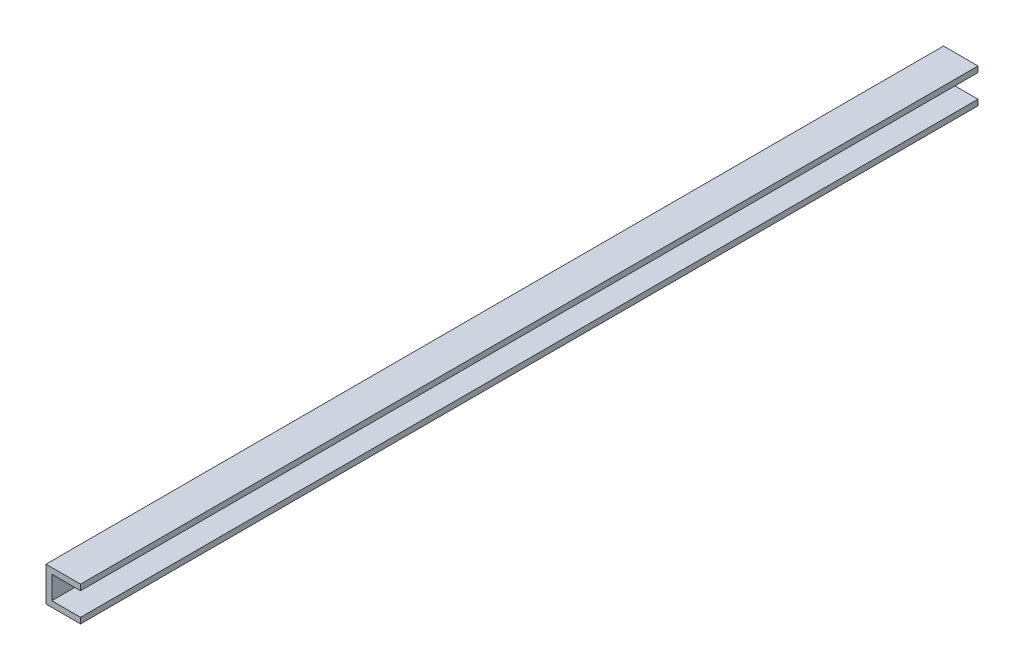
ISO-10303-21;
HEADER;
FILE_DESCRIPTION(('STEP AP214'),'2;1');
FILE_NAME('part.step','',(''),(''),'','','');
FILE_SCHEMA(('AUTOMOTIVE_DESIGN { 1 0 10303 214 1 1 1 1 }'));
ENDSEC;
DATA;
#1=APPLICATION_CONTEXT('core data for automotive mechanical design processes');
#2=APPLICATION_PROTOCOL_DEFINITION('international standard','automotive_design',2000,#1);
#3=PRODUCT_CONTEXT('',#1,'mechanical');
#4=PRODUCT('Part','Part','',(#3));
#5=PRODUCT_RELATED_PRODUCT_CATEGORY('part','',(#4));
#6=PRODUCT_DEFINITION_FORMATION('','',#4);
#7=PRODUCT_DEFINITION_CONTEXT('part definition',#1,'design');
#8=PRODUCT_DEFINITION('design','',#6,#7);
#9=PRODUCT_DEFINITION_SHAPE('','',#8);
#10=(LENGTH_UNIT() NAMED_UNIT(*) SI_UNIT(.MILLI.,.METRE.));
#11=(NAMED_UNIT(*) PLANE_ANGLE_UNIT() SI_UNIT($,.RADIAN.));
#12=(NAMED_UNIT(*) SI_UNIT($,.STERADIAN.) SOLID_ANGLE_UNIT());
#13=UNCERTAINTY_MEASURE_WITH_UNIT(LENGTH_MEASURE(1.E-05),#10,'distance_accuracy_value','');
#14=(GEOMETRIC_REPRESENTATION_CONTEXT(3) GLOBAL_UNCERTAINTY_ASSIGNED_CONTEXT((#13)) GLOBAL_UNIT_ASSIGNED_CONTEXT((#10,
#11,#12)) REPRESENTATION_CONTEXT('',''));
#15=CARTESIAN_POINT('',(0.,0.,0.));
#16=DIRECTION('',(0.,0.,1.));
#17=DIRECTION('',(1.,0.,0.));
#18=AXIS2_PLACEMENT_3D('',#15,#16,#17);
#19=CARTESIAN_POINT('',(0.,4.7625,123.825));
#20=DIRECTION('',(0.,-1.,0.));
#21=DIRECTION('',(1.,0.,0.));
#22=AXIS2_PLACEMENT_3D('',#19,#20,#21);
#23=PLANE('',#22);
#24=DIRECTION('',(-1.,0.,0.));
#25=VECTOR('',#24,1.);
#26=CARTESIAN_POINT('',(0.,4.7625,-123.825));
#27=LINE('',#26,#25);
#28=CARTESIAN_POINT('',(9.525,4.7625,-123.825));
#29=VERTEX_POINT('',#28);
#30=CARTESIAN_POINT('',(0.,4.7625,-123.825));
#31=VERTEX_POINT('',#30);
#32=EDGE_CURVE('E202',#29,#31,#27,.T.);
#33=ORIENTED_EDGE('',*,*,#32,.T.);
#34=DIRECTION('',(0.,0.,-1.));
#35=VECTOR('',#34,1.);
#36=CARTESIAN_POINT('',(0.,4.7625,123.825));
#37=LINE('',#36,#35);
#38=CARTESIAN_POINT('',(0.,4.7625,123.825));
#39=VERTEX_POINT('',#38);
#40=EDGE_CURVE('E263',#39,#31,#37,.T.);
#41=ORIENTED_EDGE('',*,*,#40,.F.);
#42=DIRECTION('',(-1.,0.,0.));
#43=VECTOR('',#42,1.);
#44=CARTESIAN_POINT('',(0.,4.7625,123.825));
#45=LINE('',#44,#43);
#46=CARTESIAN_POINT('',(9.525,4.7625,123.825));
#47=VERTEX_POINT('',#46);
#48=EDGE_CURVE('E209',#47,#39,#45,.T.);
#49=ORIENTED_EDGE('',*,*,#48,.F.);
#50=DIRECTION('',(0.,0.,-1.));
#51=VECTOR('',#50,1.);
#52=CARTESIAN_POINT('',(9.525,4.7625,123.825));
#53=LINE('',#52,#51);
#54=EDGE_CURVE('E227',#47,#29,#53,.T.);
#55=ORIENTED_EDGE('',*,*,#54,.T.);
#56=EDGE_LOOP('',(#33,#41,#49,#55));
#57=FACE_BOUND('',#56,.T.);
#58=ADVANCED_FACE('F46',(#57),#23,.F.);
#59=CARTESIAN_POINT('',(0.,4.7625,123.825));
#60=DIRECTION('',(1.,0.,0.));
#61=DIRECTION('',(0.,0.,-1.));
#62=AXIS2_PLACEMENT_3D('',#59,#60,#61);
#63=PLANE('',#62);
#64=CARTESIAN_POINT('',(0.,0.,-100.6475));
#65=DIRECTION('',(-1.,0.,0.));
#66=DIRECTION('',(0.,0.,1.));
#67=AXIS2_PLACEMENT_3D('',#64,#65,#66);
#68=CIRCLE('',#67,1.35254999999999);
#69=CARTESIAN_POINT('',(0.,0.,-99.29495));
#70=VERTEX_POINT('',#69);
#71=EDGE_CURVE('E377',#70,#70,#68,.T.);
#72=ORIENTED_EDGE('',*,*,#71,.F.);
#73=EDGE_LOOP('',(#72));
#74=FACE_BOUND('',#73,.T.);
#75=CARTESIAN_POINT('',(0.,0.,-87.80859375));
#76=DIRECTION('',(-1.,0.,0.));
#77=DIRECTION('',(0.,0.,1.));
#78=AXIS2_PLACEMENT_3D('',#75,#76,#77);
#79=CIRCLE('',#78,1.35254999999999);
#80=CARTESIAN_POINT('',(0.,0.,-86.45604375));
#81=VERTEX_POINT('',#80);
#82=EDGE_CURVE('E371',#81,#81,#79,.T.);
#83=ORIENTED_EDGE('',*,*,#82,.F.);
#84=EDGE_LOOP('',(#83));
#85=FACE_BOUND('',#84,.T.);
#86=CARTESIAN_POINT('',(0.,0.,-74.9696875));
#87=DIRECTION('',(-1.,0.,0.));
#88=DIRECTION('',(0.,0.,1.));
#89=AXIS2_PLACEMENT_3D('',#86,#87,#88);
#90=CIRCLE('',#89,1.35254999999999);
#91=CARTESIAN_POINT('',(0.,0.,-73.6171375));
#92=VERTEX_POINT('',#91);
#93=EDGE_CURVE('E365',#92,#92,#90,.T.);
#94=ORIENTED_EDGE('',*,*,#93,.F.);
#95=EDGE_LOOP('',(#94));
#96=FACE_BOUND('',#95,.T.);
#97=CARTESIAN_POINT('',(0.,0.,-62.13078125));
#98=DIRECTION('',(-1.,0.,0.));
#99=DIRECTION('',(0.,0.,1.));
#100=AXIS2_PLACEMENT_3D('',#97,#98,#99);
#101=CIRCLE('',#100,1.35254999999999);
#102=CARTESIAN_POINT('',(0.,0.,-60.77823125));
#103=VERTEX_POINT('',#102);
#104=EDGE_CURVE('E359',#103,#103,#101,.T.);
#105=ORIENTED_EDGE('',*,*,#104,.F.);
#106=EDGE_LOOP('',(#105));
#107=FACE_BOUND('',#106,.T.);
#108=CARTESIAN_POINT('',(0.,0.,-49.291875));
#109=DIRECTION('',(-1.,0.,0.));
#110=DIRECTION('',(0.,0.,1.));
#111=AXIS2_PLACEMENT_3D('',#108,#109,#110);
#112=CIRCLE('',#111,1.35254999999999);
#113=CARTESIAN_POINT('',(0.,0.,-47.9393250000001));
#114=VERTEX_POINT('',#113);
#115=EDGE_CURVE('E353',#114,#114,#112,.T.);
#116=ORIENTED_EDGE('',*,*,#115,.F.);
#117=EDGE_LOOP('',(#116));
#118=FACE_BOUND('',#117,.T.);
#119=CARTESIAN_POINT('',(0.,0.,-36.4529687500001));
#120=DIRECTION('',(-1.,0.,0.));
#121=DIRECTION('',(0.,0.,1.));
#122=AXIS2_PLACEMENT_3D('',#119,#120,#121);
#123=CIRCLE('',#122,1.35254999999999);
#124=CARTESIAN_POINT('',(0.,0.,-35.1004187500001));
#125=VERTEX_POINT('',#124);
#126=EDGE_CURVE('E347',#125,#125,#123,.T.);
#127=ORIENTED_EDGE('',*,*,#126,.F.);
#128=EDGE_LOOP('',(#127));
#129=FACE_BOUND('',#128,.T.);
#130=CARTESIAN_POINT('',(0.,0.,-23.6140625000001));
#131=DIRECTION('',(-1.,0.,0.));
#132=DIRECTION('',(0.,0.,1.));
#133=AXIS2_PLACEMENT_3D('',#130,#131,#132);
#134=CIRCLE('',#133,1.35254999999999);
#135=CARTESIAN_POINT('',(0.,0.,-22.2615125000001));
#136=VERTEX_POINT('',#135);
#137=EDGE_CURVE('E341',#136,#136,#134,.T.);
#138=ORIENTED_EDGE('',*,*,#137,.F.);
#139=EDGE_LOOP('',(#138));
#140=FACE_BOUND('',#139,.T.);
#141=CARTESIAN_POINT('',(0.,0.,-10.7751562500001));
#142=DIRECTION('',(-1.,0.,0.));
#143=DIRECTION('',(0.,0.,1.));
#144=AXIS2_PLACEMENT_3D('',#141,#142,#143);
#145=CIRCLE('',#144,1.35254999999999);
#146=CARTESIAN_POINT('',(0.,0.,-9.4226062500001));
#147=VERTEX_POINT('',#146);
#148=EDGE_CURVE('E335',#147,#147,#145,.T.);
#149=ORIENTED_EDGE('',*,*,#148,.F.);
#150=EDGE_LOOP('',(#149));
#151=FACE_BOUND('',#150,.T.);
#152=CARTESIAN_POINT('',(0.,0.,2.06374999999989));
#153=DIRECTION('',(-1.,0.,0.));
#154=DIRECTION('',(0.,0.,1.));
#155=AXIS2_PLACEMENT_3D('',#152,#153,#154);
#156=CIRCLE('',#155,1.35254999999999);
#157=CARTESIAN_POINT('',(0.,0.,3.41629999999988));
#158=VERTEX_POINT('',#157);
#159=EDGE_CURVE('E329',#158,#158,#156,.T.);
#160=ORIENTED_EDGE('',*,*,#159,.F.);
#161=EDGE_LOOP('',(#160));
#162=FACE_BOUND('',#161,.T.);
#163=CARTESIAN_POINT('',(0.,0.,14.9026562499999));
#164=DIRECTION('',(-1.,0.,0.));
#165=DIRECTION('',(0.,0.,1.));
#166=AXIS2_PLACEMENT_3D('',#163,#164,#165);
#167=CIRCLE('',#166,1.35254999999999);
#168=CARTESIAN_POINT('',(0.,0.,16.2552062499999));
#169=VERTEX_POINT('',#168);
#170=EDGE_CURVE('E323',#169,#169,#167,.T.);
#171=ORIENTED_EDGE('',*,*,#170,.F.);
#172=EDGE_LOOP('',(#171));
#173=FACE_BOUND('',#172,.T.);
#174=CARTESIAN_POINT('',(0.,0.,27.7415624999998));
#175=DIRECTION('',(-1.,0.,0.));
#176=DIRECTION('',(0.,0.,1.));
#177=AXIS2_PLACEMENT_3D('',#174,#175,#176);
#178=CIRCLE('',#177,1.35254999999999);
#179=CARTESIAN_POINT('',(0.,0.,29.0941124999998));
#180=VERTEX_POINT('',#179);
#181=EDGE_CURVE('E317',#180,#180,#178,.T.);
#182=ORIENTED_EDGE('',*,*,#181,.F.);
#183=EDGE_LOOP('',(#182));
#184=FACE_BOUND('',#183,.T.);
#185=CARTESIAN_POINT('',(0.,0.,40.5804687499998));
#186=DIRECTION('',(-1.,0.,0.));
#187=DIRECTION('',(0.,0.,1.));
#188=AXIS2_PLACEMENT_3D('',#185,#186,#187);
#189=CIRCLE('',#188,1.35254999999999);
#190=CARTESIAN_POINT('',(0.,0.,41.9330187499998));
#191=VERTEX_POINT('',#190);
#192=EDGE_CURVE('E311',#191,#191,#189,.T.);
#193=ORIENTED_EDGE('',*,*,#192,.F.);
#194=EDGE_LOOP('',(#193));
#195=FACE_BOUND('',#194,.T.);
#196=CARTESIAN_POINT('',(0.,0.,53.4193749999998));
#197=DIRECTION('',(-1.,0.,0.));
#198=DIRECTION('',(0.,0.,1.));
#199=AXIS2_PLACEMENT_3D('',#196,#197,#198);
#200=CIRCLE('',#199,1.35254999999999);
#201=CARTESIAN_POINT('',(0.,0.,54.7719249999998));
#202=VERTEX_POINT('',#201);
#203=EDGE_CURVE('E305',#202,#202,#200,.T.);
#204=ORIENTED_EDGE('',*,*,#203,.F.);
#205=EDGE_LOOP('',(#204));
#206=FACE_BOUND('',#205,.T.);
#207=CARTESIAN_POINT('',(0.,0.,66.2582812499998));
#208=DIRECTION('',(-1.,0.,0.));
#209=DIRECTION('',(0.,0.,1.));
#210=AXIS2_PLACEMENT_3D('',#207,#208,#209);
#211=CIRCLE('',#210,1.35254999999999);
#212=CARTESIAN_POINT('',(0.,0.,67.6108312499998));
#213=VERTEX_POINT('',#212);
#214=EDGE_CURVE('E298',#213,#213,#211,.T.);
#215=ORIENTED_EDGE('',*,*,#214,.F.);
#216=EDGE_LOOP('',(#215));
#217=FACE_BOUND('',#216,.T.);
#218=CARTESIAN_POINT('',(0.,0.,79.0971874999998));
#219=DIRECTION('',(-1.,0.,0.));
#220=DIRECTION('',(0.,0.,1.));
#221=AXIS2_PLACEMENT_3D('',#218,#219,#220);
#222=CIRCLE('',#221,1.35254999999999);
#223=CARTESIAN_POINT('',(0.,0.,80.4497374999998));
#224=VERTEX_POINT('',#223);
#225=EDGE_CURVE('E288',#224,#224,#222,.T.);
#226=ORIENTED_EDGE('',*,*,#225,.F.);
#227=EDGE_LOOP('',(#226));
#228=FACE_BOUND('',#227,.T.);
#229=CARTESIAN_POINT('',(0.,0.,91.9360937499998));
#230=DIRECTION('',(-1.,0.,0.));
#231=DIRECTION('',(0.,0.,1.));
#232=AXIS2_PLACEMENT_3D('',#229,#230,#231);
#233=CIRCLE('',#232,1.35254999999999);
#234=CARTESIAN_POINT('',(0.,0.,93.2886437499998));
#235=VERTEX_POINT('',#234);
#236=EDGE_CURVE('E285',#235,#235,#233,.T.);
#237=ORIENTED_EDGE('',*,*,#236,.F.);
#238=EDGE_LOOP('',(#237));
#239=FACE_BOUND('',#238,.T.);
#240=DIRECTION('',(0.,0.,1.));
#241=VECTOR('',#240,1.);
#242=CARTESIAN_POINT('',(0.,-2.38125,-114.935));
#243=LINE('',#242,#241);
#244=CARTESIAN_POINT('',(0.,-2.38125,-114.935));
#245=VERTEX_POINT('',#244);
#246=CARTESIAN_POINT('',(0.,-2.38125,-113.3475));
#247=VERTEX_POINT('',#246);
#248=EDGE_CURVE('E172',#245,#247,#243,.T.);
#249=ORIENTED_EDGE('',*,*,#248,.F.);
#250=DIRECTION('',(0.,-1.,0.));
#251=VECTOR('',#250,1.);
#252=CARTESIAN_POINT('',(0.,-2.38125,-114.935));
#253=LINE('',#252,#251);
#254=CARTESIAN_POINT('',(0.,2.38125,-114.935));
#255=VERTEX_POINT('',#254);
#256=EDGE_CURVE('E62',#255,#245,#253,.T.);
#257=ORIENTED_EDGE('',*,*,#256,.F.);
#258=DIRECTION('',(0.,0.,-1.));
#259=VECTOR('',#258,1.);
#260=CARTESIAN_POINT('',(0.,2.38125,-114.935));
#261=LINE('',#260,#259);
#262=CARTESIAN_POINT('',(0.,2.38125,-113.3475));
#263=VERTEX_POINT('',#262);
#264=EDGE_CURVE('E179',#263,#255,#261,.T.);
#265=ORIENTED_EDGE('',*,*,#264,.F.);
#266=DIRECTION('',(0.,1.,0.));
#267=VECTOR('',#266,1.);
#268=CARTESIAN_POINT('',(0.,-2.38125,-113.3475));
#269=LINE('',#268,#267);
#270=EDGE_CURVE('E163',#247,#263,#269,.T.);
#271=ORIENTED_EDGE('',*,*,#270,.F.);
#272=EDGE_LOOP('',(#249,#257,#265,#271));
#273=FACE_BOUND('',#272,.T.);
#274=DIRECTION('',(0.,0.,1.));
#275=VECTOR('',#274,1.);
#276=CARTESIAN_POINT('',(0.,-2.38125,-119.6975));
#277=LINE('',#276,#275);
#278=CARTESIAN_POINT('',(0.,-2.38125,-121.285));
#279=VERTEX_POINT('',#278);
#280=CARTESIAN_POINT('',(0.,-2.38125,-119.6975));
#281=VERTEX_POINT('',#280);
#282=EDGE_CURVE('E190',#279,#281,#277,.T.);
#283=ORIENTED_EDGE('',*,*,#282,.F.);
#284=DIRECTION('',(0.,-1.,0.));
#285=VECTOR('',#284,1.);
#286=CARTESIAN_POINT('',(0.,-2.38125,-121.285));
#287=LINE('',#286,#285);
#288=CARTESIAN_POINT('',(0.,2.38125,-121.285));
#289=VERTEX_POINT('',#288);
#290=EDGE_CURVE('E186',#289,#279,#287,.T.);
#291=ORIENTED_EDGE('',*,*,#290,.F.);
#292=DIRECTION('',(0.,0.,-1.));
#293=VECTOR('',#292,1.);
#294=CARTESIAN_POINT('',(0.,2.38125,-119.6975));
#295=LINE('',#294,#293);
#296=CARTESIAN_POINT('',(0.,2.38125,-119.6975));
#297=VERTEX_POINT('',#296);
#298=EDGE_CURVE('E196',#297,#289,#295,.T.);
#299=ORIENTED_EDGE('',*,*,#298,.F.);
#300=DIRECTION('',(0.,1.,0.));
#301=VECTOR('',#300,1.);
#302=CARTESIAN_POINT('',(0.,-2.38125,-119.6975));
#303=LINE('',#302,#301);
#304=EDGE_CURVE('E193',#281,#297,#303,.T.);
#305=ORIENTED_EDGE('',*,*,#304,.F.);
#306=EDGE_LOOP('',(#283,#291,#299,#305));
#307=FACE_BOUND('',#306,.T.);
#308=DIRECTION('',(0.,-1.,0.));
#309=VECTOR('',#308,1.);
#310=CARTESIAN_POINT('',(0.,4.7625,-123.825));
#311=LINE('',#310,#309);
#312=CARTESIAN_POINT('',(0.,-4.7625,-123.825));
#313=VERTEX_POINT('',#312);
#314=EDGE_CURVE('E230',#31,#313,#311,.T.);
#315=ORIENTED_EDGE('',*,*,#314,.T.);
#316=DIRECTION('',(0.,0.,-1.));
#317=VECTOR('',#316,1.);
#318=CARTESIAN_POINT('',(0.,-4.7625,123.825));
#319=LINE('',#318,#317);
#320=CARTESIAN_POINT('',(0.,-4.7625,123.825));
#321=VERTEX_POINT('',#320);
#322=EDGE_CURVE('E260',#321,#313,#319,.T.);
#323=ORIENTED_EDGE('',*,*,#322,.F.);
#324=DIRECTION('',(0.,-1.,0.));
#325=VECTOR('',#324,1.);
#326=CARTESIAN_POINT('',(0.,4.7625,123.825));
#327=LINE('',#326,#325);
#328=EDGE_CURVE('E212',#39,#321,#327,.T.);
#329=ORIENTED_EDGE('',*,*,#328,.F.);
#330=ORIENTED_EDGE('',*,*,#40,.T.);
#331=EDGE_LOOP('',(#315,#323,#329,#330));
#332=FACE_BOUND('',#331,.T.);
#333=ADVANCED_FACE('F176',(#74,#85,#96,#107,#118,#129,#140,#151,#162,#173,#184,#195,#206,#217,
#228,#239,#273,#307,#332),#63,.F.);
#334=CARTESIAN_POINT('',(0.,-4.7625,123.825));
#335=DIRECTION('',(0.,1.,0.));
#336=DIRECTION('',(-1.,0.,0.));
#337=AXIS2_PLACEMENT_3D('',#334,#335,#336);
#338=PLANE('',#337);
#339=DIRECTION('',(1.,0.,0.));
#340=VECTOR('',#339,1.);
#341=CARTESIAN_POINT('',(0.,-4.7625,-123.825));
#342=LINE('',#341,#340);
#343=CARTESIAN_POINT('',(9.525,-4.7625,-123.825));
#344=VERTEX_POINT('',#343);
#345=EDGE_CURVE('E232',#313,#344,#342,.T.);
#346=ORIENTED_EDGE('',*,*,#345,.T.);
#347=DIRECTION('',(0.,0.,-1.));
#348=VECTOR('',#347,1.);
#349=CARTESIAN_POINT('',(9.525,-4.7625,123.825));
#350=LINE('',#349,#348);
#351=CARTESIAN_POINT('',(9.525,-4.7625,123.825));
#352=VERTEX_POINT('',#351);
#353=EDGE_CURVE('E257',#352,#344,#350,.T.);
#354=ORIENTED_EDGE('',*,*,#353,.F.);
#355=DIRECTION('',(1.,0.,0.));
#356=VECTOR('',#355,1.);
#357=CARTESIAN_POINT('',(0.,-4.7625,123.825));
#358=LINE('',#357,#356);
#359=EDGE_CURVE('E215',#321,#352,#358,.T.);
#360=ORIENTED_EDGE('',*,*,#359,.F.);
#361=ORIENTED_EDGE('',*,*,#322,.T.);
#362=EDGE_LOOP('',(#346,#354,#360,#361));
#363=FACE_BOUND('',#362,.T.);
#364=ADVANCED_FACE('F386',(#363),#338,.F.);
#365=CARTESIAN_POINT('',(9.525,-4.7625,123.825));
#366=DIRECTION('',(-1.,0.,0.));
#367=DIRECTION('',(0.,-1.,0.));
#368=AXIS2_PLACEMENT_3D('',#365,#366,#367);
#369=PLANE('',#368);
#370=DIRECTION('',(0.,1.,0.));
#371=VECTOR('',#370,1.);
#372=CARTESIAN_POINT('',(9.525,-4.7625,-123.825));
#373=LINE('',#372,#371);
#374=CARTESIAN_POINT('',(9.525,-3.175,-123.825));
#375=VERTEX_POINT('',#374);
#376=EDGE_CURVE('E234',#344,#375,#373,.T.);
#377=ORIENTED_EDGE('',*,*,#376,.T.);
#378=DIRECTION('',(0.,0.,-1.));
#379=VECTOR('',#378,1.);
#380=CARTESIAN_POINT('',(9.525,-3.175,123.825));
#381=LINE('',#380,#379);
#382=CARTESIAN_POINT('',(9.525,-3.175,123.825));
#383=VERTEX_POINT('',#382);
#384=EDGE_CURVE('E254',#383,#375,#381,.T.);
#385=ORIENTED_EDGE('',*,*,#384,.F.);
#386=DIRECTION('',(0.,1.,0.));
#387=VECTOR('',#386,1.);
#388=CARTESIAN_POINT('',(9.525,-4.7625,123.825));
#389=LINE('',#388,#387);
#390=EDGE_CURVE('E217',#352,#383,#389,.T.);
#391=ORIENTED_EDGE('',*,*,#390,.F.);
#392=ORIENTED_EDGE('',*,*,#353,.T.);
#393=EDGE_LOOP('',(#377,#385,#391,#392));
#394=FACE_BOUND('',#393,.T.);
#395=ADVANCED_FACE('F462',(#394),#369,.F.);
#396=CARTESIAN_POINT('',(9.525,-3.175,123.825));
#397=DIRECTION('',(0.,-1.,0.));
#398=DIRECTION('',(1.,0.,0.));
#399=AXIS2_PLACEMENT_3D('',#396,#397,#398);
#400=PLANE('',#399);
#401=DIRECTION('',(-1.,0.,0.));
#402=VECTOR('',#401,1.);
#403=CARTESIAN_POINT('',(9.525,-3.175,-123.825));
#404=LINE('',#403,#402);
#405=CARTESIAN_POINT('',(1.5875,-3.175,-123.825));
#406=VERTEX_POINT('',#405);
#407=EDGE_CURVE('E236',#375,#406,#404,.T.);
#408=ORIENTED_EDGE('',*,*,#407,.T.);
#409=DIRECTION('',(0.,0.,-1.));
#410=VECTOR('',#409,1.);
#411=CARTESIAN_POINT('',(1.5875,-3.175,123.825));
#412=LINE('',#411,#410);
#413=CARTESIAN_POINT('',(1.5875,-3.175,123.825));
#414=VERTEX_POINT('',#413);
#415=EDGE_CURVE('E251',#414,#406,#412,.T.);
#416=ORIENTED_EDGE('',*,*,#415,.F.);
#417=DIRECTION('',(-1.,0.,0.));
#418=VECTOR('',#417,1.);
#419=CARTESIAN_POINT('',(9.525,-3.175,123.825));
#420=LINE('',#419,#418);
#421=EDGE_CURVE('E219',#383,#414,#420,.T.);
#422=ORIENTED_EDGE('',*,*,#421,.F.);
#423=ORIENTED_EDGE('',*,*,#384,.T.);
#424=EDGE_LOOP('',(#408,#416,#422,#423));
#425=FACE_BOUND('',#424,.T.);
#426=ADVANCED_FACE('F427',(#425),#400,.F.);
#427=CARTESIAN_POINT('',(1.5875,3.175,123.825));
#428=DIRECTION('',(-1.,0.,0.));
#429=DIRECTION('',(0.,0.,1.));
#430=AXIS2_PLACEMENT_3D('',#427,#428,#429);
#431=PLANE('',#430);
#432=CARTESIAN_POINT('',(1.5875,0.,-100.6475));
#433=DIRECTION('',(-1.,0.,0.));
#434=DIRECTION('',(0.,0.,1.));
#435=AXIS2_PLACEMENT_3D('',#432,#433,#434);
#436=CIRCLE('',#435,1.35254999999999);
#437=CARTESIAN_POINT('',(1.5875,0.,-99.29495));
#438=VERTEX_POINT('',#437);
#439=EDGE_CURVE('E374',#438,#438,#436,.T.);
#440=ORIENTED_EDGE('',*,*,#439,.T.);
#441=EDGE_LOOP('',(#440));
#442=FACE_BOUND('',#441,.T.);
#443=CARTESIAN_POINT('',(1.5875,0.,-87.80859375));
#444=DIRECTION('',(-1.,0.,0.));
#445=DIRECTION('',(0.,0.,1.));
#446=AXIS2_PLACEMENT_3D('',#443,#444,#445);
#447=CIRCLE('',#446,1.35254999999999);
#448=CARTESIAN_POINT('',(1.5875,0.,-86.45604375));
#449=VERTEX_POINT('',#448);
#450=EDGE_CURVE('E368',#449,#449,#447,.T.);
#451=ORIENTED_EDGE('',*,*,#450,.T.);
#452=EDGE_LOOP('',(#451));
#453=FACE_BOUND('',#452,.T.);
#454=CARTESIAN_POINT('',(1.5875,0.,-74.9696875));
#455=DIRECTION('',(-1.,0.,0.));
#456=DIRECTION('',(0.,0.,1.));
#457=AXIS2_PLACEMENT_3D('',#454,#455,#456);
#458=CIRCLE('',#457,1.35254999999999);
#459=CARTESIAN_POINT('',(1.5875,0.,-73.6171375));
#460=VERTEX_POINT('',#459);
#461=EDGE_CURVE('E362',#460,#460,#458,.T.);
#462=ORIENTED_EDGE('',*,*,#461,.T.);
#463=EDGE_LOOP('',(#462));
#464=FACE_BOUND('',#463,.T.);
#465=CARTESIAN_POINT('',(1.5875,0.,-62.13078125));
#466=DIRECTION('',(-1.,0.,0.));
#467=DIRECTION('',(0.,0.,1.));
#468=AXIS2_PLACEMENT_3D('',#465,#466,#467);
#469=CIRCLE('',#468,1.35254999999999);
#470=CARTESIAN_POINT('',(1.5875,0.,-60.77823125));
#471=VERTEX_POINT('',#470);
#472=EDGE_CURVE('E356',#471,#471,#469,.T.);
#473=ORIENTED_EDGE('',*,*,#472,.T.);
#474=EDGE_LOOP('',(#473));
#475=FACE_BOUND('',#474,.T.);
#476=CARTESIAN_POINT('',(1.5875,0.,-49.291875));
#477=DIRECTION('',(-1.,0.,0.));
#478=DIRECTION('',(0.,0.,1.));
#479=AXIS2_PLACEMENT_3D('',#476,#477,#478);
#480=CIRCLE('',#479,1.35254999999999);
#481=CARTESIAN_POINT('',(1.5875,0.,-47.9393250000001));
#482=VERTEX_POINT('',#481);
#483=EDGE_CURVE('E350',#482,#482,#480,.T.);
#484=ORIENTED_EDGE('',*,*,#483,.T.);
#485=EDGE_LOOP('',(#484));
#486=FACE_BOUND('',#485,.T.);
#487=CARTESIAN_POINT('',(1.5875,0.,-36.4529687500001));
#488=DIRECTION('',(-1.,0.,0.));
#489=DIRECTION('',(0.,0.,1.));
#490=AXIS2_PLACEMENT_3D('',#487,#488,#489);
#491=CIRCLE('',#490,1.35254999999999);
#492=CARTESIAN_POINT('',(1.5875,0.,-35.1004187500001));
#493=VERTEX_POINT('',#492);
#494=EDGE_CURVE('E344',#493,#493,#491,.T.);
#495=ORIENTED_EDGE('',*,*,#494,.T.);
#496=EDGE_LOOP('',(#495));
#497=FACE_BOUND('',#496,.T.);
#498=CARTESIAN_POINT('',(1.5875,0.,-23.6140625000001));
#499=DIRECTION('',(-1.,0.,0.));
#500=DIRECTION('',(0.,0.,1.));
#501=AXIS2_PLACEMENT_3D('',#498,#499,#500);
#502=CIRCLE('',#501,1.35254999999999);
#503=CARTESIAN_POINT('',(1.5875,0.,-22.2615125000001));
#504=VERTEX_POINT('',#503);
#505=EDGE_CURVE('E338',#504,#504,#502,.T.);
#506=ORIENTED_EDGE('',*,*,#505,.T.);
#507=EDGE_LOOP('',(#506));
#508=FACE_BOUND('',#507,.T.);
#509=CARTESIAN_POINT('',(1.5875,0.,-10.7751562500001));
#510=DIRECTION('',(-1.,0.,0.));
#511=DIRECTION('',(0.,0.,1.));
#512=AXIS2_PLACEMENT_3D('',#509,#510,#511);
#513=CIRCLE('',#512,1.35254999999999);
#514=CARTESIAN_POINT('',(1.5875,0.,-9.4226062500001));
#515=VERTEX_POINT('',#514);
#516=EDGE_CURVE('E332',#515,#515,#513,.T.);
#517=ORIENTED_EDGE('',*,*,#516,.T.);
#518=EDGE_LOOP('',(#517));
#519=FACE_BOUND('',#518,.T.);
#520=CARTESIAN_POINT('',(1.5875,0.,2.06374999999989));
#521=DIRECTION('',(-1.,0.,0.));
#522=DIRECTION('',(0.,0.,1.));
#523=AXIS2_PLACEMENT_3D('',#520,#521,#522);
#524=CIRCLE('',#523,1.35254999999999);
#525=CARTESIAN_POINT('',(1.5875,0.,3.41629999999988));
#526=VERTEX_POINT('',#525);
#527=EDGE_CURVE('E326',#526,#526,#524,.T.);
#528=ORIENTED_EDGE('',*,*,#527,.T.);
#529=EDGE_LOOP('',(#528));
#530=FACE_BOUND('',#529,.T.);
#531=CARTESIAN_POINT('',(1.5875,0.,14.9026562499999));
#532=DIRECTION('',(-1.,0.,0.));
#533=DIRECTION('',(0.,0.,1.));
#534=AXIS2_PLACEMENT_3D('',#531,#532,#533);
#535=CIRCLE('',#534,1.35254999999999);
#536=CARTESIAN_POINT('',(1.5875,0.,16.2552062499999));
#537=VERTEX_POINT('',#536);
#538=EDGE_CURVE('E320',#537,#537,#535,.T.);
#539=ORIENTED_EDGE('',*,*,#538,.T.);
#540=EDGE_LOOP('',(#539));
#541=FACE_BOUND('',#540,.T.);
#542=CARTESIAN_POINT('',(1.5875,0.,27.7415624999998));
#543=DIRECTION('',(-1.,0.,0.));
#544=DIRECTION('',(0.,0.,1.));
#545=AXIS2_PLACEMENT_3D('',#542,#543,#544);
#546=CIRCLE('',#545,1.35254999999999);
#547=CARTESIAN_POINT('',(1.5875,0.,29.0941124999998));
#548=VERTEX_POINT('',#547);
#549=EDGE_CURVE('E314',#548,#548,#546,.T.);
#550=ORIENTED_EDGE('',*,*,#549,.T.);
#551=EDGE_LOOP('',(#550));
#552=FACE_BOUND('',#551,.T.);
#553=CARTESIAN_POINT('',(1.5875,0.,40.5804687499998));
#554=DIRECTION('',(-1.,0.,0.));
#555=DIRECTION('',(0.,0.,1.));
#556=AXIS2_PLACEMENT_3D('',#553,#554,#555);
#557=CIRCLE('',#556,1.35254999999999);
#558=CARTESIAN_POINT('',(1.5875,0.,41.9330187499998));
#559=VERTEX_POINT('',#558);
#560=EDGE_CURVE('E308',#559,#559,#557,.T.);
#561=ORIENTED_EDGE('',*,*,#560,.T.);
#562=EDGE_LOOP('',(#561));
#563=FACE_BOUND('',#562,.T.);
#564=CARTESIAN_POINT('',(1.5875,0.,53.4193749999998));
#565=DIRECTION('',(-1.,0.,0.));
#566=DIRECTION('',(0.,0.,1.));
#567=AXIS2_PLACEMENT_3D('',#564,#565,#566);
#568=CIRCLE('',#567,1.35254999999999);
#569=CARTESIAN_POINT('',(1.5875,0.,54.7719249999998));
#570=VERTEX_POINT('',#569);
#571=EDGE_CURVE('E302',#570,#570,#568,.T.);
#572=ORIENTED_EDGE('',*,*,#571,.T.);
#573=EDGE_LOOP('',(#572));
#574=FACE_BOUND('',#573,.T.);
#575=CARTESIAN_POINT('',(1.5875,0.,66.2582812499998));
#576=DIRECTION('',(-1.,0.,0.));
#577=DIRECTION('',(0.,0.,1.));
#578=AXIS2_PLACEMENT_3D('',#575,#576,#577);
#579=CIRCLE('',#578,1.35254999999999);
#580=CARTESIAN_POINT('',(1.5875,0.,67.6108312499998));
#581=VERTEX_POINT('',#580);
#582=EDGE_CURVE('E49',#581,#581,#579,.T.);
#583=ORIENTED_EDGE('',*,*,#582,.T.);
#584=EDGE_LOOP('',(#583));
#585=FACE_BOUND('',#584,.T.);
#586=CARTESIAN_POINT('',(1.5875,0.,79.0971874999998));
#587=DIRECTION('',(-1.,0.,0.));
#588=DIRECTION('',(0.,0.,1.));
#589=AXIS2_PLACEMENT_3D('',#586,#587,#588);
#590=CIRCLE('',#589,1.35254999999999);
#591=CARTESIAN_POINT('',(1.5875,0.,80.4497374999998));
#592=VERTEX_POINT('',#591);
#593=EDGE_CURVE('E286',#592,#592,#590,.T.);
#594=ORIENTED_EDGE('',*,*,#593,.T.);
#595=EDGE_LOOP('',(#594));
#596=FACE_BOUND('',#595,.T.);
#597=CARTESIAN_POINT('',(1.5875,0.,91.9360937499998));
#598=DIRECTION('',(-1.,0.,0.));
#599=DIRECTION('',(0.,0.,1.));
#600=AXIS2_PLACEMENT_3D('',#597,#598,#599);
#601=CIRCLE('',#600,1.35254999999999);
#602=CARTESIAN_POINT('',(1.5875,0.,93.2886437499998));
#603=VERTEX_POINT('',#602);
#604=EDGE_CURVE('E283',#603,#603,#601,.T.);
#605=ORIENTED_EDGE('',*,*,#604,.T.);
#606=EDGE_LOOP('',(#605));
#607=FACE_BOUND('',#606,.T.);
#608=DIRECTION('',(0.,0.,-1.));
#609=VECTOR('',#608,1.);
#610=CARTESIAN_POINT('',(1.5875,2.38125000000007,123.825));
#611=LINE('',#610,#609);
#612=CARTESIAN_POINT('',(1.5875,2.38125,-113.3475));
#613=VERTEX_POINT('',#612);
#614=CARTESIAN_POINT('',(1.5875,2.38125,-114.935));
#615=VERTEX_POINT('',#614);
#616=EDGE_CURVE('E54',#613,#615,#611,.T.);
#617=ORIENTED_EDGE('',*,*,#616,.T.);
#618=DIRECTION('',(0.,-1.,0.));
#619=VECTOR('',#618,1.);
#620=CARTESIAN_POINT('',(1.5875,3.175,-114.935));
#621=LINE('',#620,#619);
#622=CARTESIAN_POINT('',(1.5875,-2.38125,-114.935));
#623=VERTEX_POINT('',#622);
#624=EDGE_CURVE('E13',#615,#623,#621,.T.);
#625=ORIENTED_EDGE('',*,*,#624,.T.);
#626=DIRECTION('',(0.,0.,1.));
#627=VECTOR('',#626,1.);
#628=CARTESIAN_POINT('',(1.5875,-2.38125,123.825));
#629=LINE('',#628,#627);
#630=CARTESIAN_POINT('',(1.5875,-2.38125,-113.3475));
#631=VERTEX_POINT('',#630);
#632=EDGE_CURVE('E278',#623,#631,#629,.T.);
#633=ORIENTED_EDGE('',*,*,#632,.T.);
#634=DIRECTION('',(0.,1.,0.));
#635=VECTOR('',#634,1.);
#636=CARTESIAN_POINT('',(1.5875,3.175,-113.3475));
#637=LINE('',#636,#635);
#638=EDGE_CURVE('E166',#631,#613,#637,.T.);
#639=ORIENTED_EDGE('',*,*,#638,.T.);
#640=EDGE_LOOP('',(#617,#625,#633,#639));
#641=FACE_BOUND('',#640,.T.);
#642=DIRECTION('',(0.,0.,-1.));
#643=VECTOR('',#642,1.);
#644=CARTESIAN_POINT('',(1.5875,2.38125,123.825));
#645=LINE('',#644,#643);
#646=CARTESIAN_POINT('',(1.5875,2.38125,-119.6975));
#647=VERTEX_POINT('',#646);
#648=CARTESIAN_POINT('',(1.5875,2.38125,-121.285));
#649=VERTEX_POINT('',#648);
#650=EDGE_CURVE('E272',#647,#649,#645,.T.);
#651=ORIENTED_EDGE('',*,*,#650,.T.);
#652=DIRECTION('',(0.,-1.,0.));
#653=VECTOR('',#652,1.);
#654=CARTESIAN_POINT('',(1.5875,3.175,-121.285));
#655=LINE('',#654,#653);
#656=CARTESIAN_POINT('',(1.5875,-2.38125,-121.285));
#657=VERTEX_POINT('',#656);
#658=EDGE_CURVE('E275',#649,#657,#655,.T.);
#659=ORIENTED_EDGE('',*,*,#658,.T.);
#660=DIRECTION('',(0.,0.,1.));
#661=VECTOR('',#660,1.);
#662=CARTESIAN_POINT('',(1.5875,-2.38124999999993,123.825));
#663=LINE('',#662,#661);
#664=CARTESIAN_POINT('',(1.5875,-2.38125,-119.6975));
#665=VERTEX_POINT('',#664);
#666=EDGE_CURVE('E266',#657,#665,#663,.T.);
#667=ORIENTED_EDGE('',*,*,#666,.T.);
#668=DIRECTION('',(0.,1.,0.));
#669=VECTOR('',#668,1.);
#670=CARTESIAN_POINT('',(1.5875,3.175,-119.6975));
#671=LINE('',#670,#669);
#672=EDGE_CURVE('E269',#665,#647,#671,.T.);
#673=ORIENTED_EDGE('',*,*,#672,.T.);
#674=EDGE_LOOP('',(#651,#659,#667,#673));
#675=FACE_BOUND('',#674,.T.);
#676=DIRECTION('',(0.,1.,0.));
#677=VECTOR('',#676,1.);
#678=CARTESIAN_POINT('',(1.5875,3.175,-123.825));
#679=LINE('',#678,#677);
#680=CARTESIAN_POINT('',(1.5875,3.175,-123.825));
#681=VERTEX_POINT('',#680);
#682=EDGE_CURVE('E238',#406,#681,#679,.T.);
#683=ORIENTED_EDGE('',*,*,#682,.T.);
#684=DIRECTION('',(0.,0.,-1.));
#685=VECTOR('',#684,1.);
#686=CARTESIAN_POINT('',(1.5875,3.175,123.825));
#687=LINE('',#686,#685);
#688=CARTESIAN_POINT('',(1.5875,3.175,123.825));
#689=VERTEX_POINT('',#688);
#690=EDGE_CURVE('E248',#689,#681,#687,.T.);
#691=ORIENTED_EDGE('',*,*,#690,.F.);
#692=DIRECTION('',(0.,1.,0.));
#693=VECTOR('',#692,1.);
#694=CARTESIAN_POINT('',(1.5875,3.175,123.825));
#695=LINE('',#694,#693);
#696=EDGE_CURVE('E221',#414,#689,#695,.T.);
#697=ORIENTED_EDGE('',*,*,#696,.F.);
#698=ORIENTED_EDGE('',*,*,#415,.T.);
#699=EDGE_LOOP('',(#683,#691,#697,#698));
#700=FACE_BOUND('',#699,.T.);
#701=ADVANCED_FACE('F423',(#442,#453,#464,#475,#486,#497,#508,#519,#530,#541,#552,#563,#574,
#585,#596,#607,#641,#675,#700),#431,.F.);
#702=CARTESIAN_POINT('',(9.525,3.175,123.825));
#703=DIRECTION('',(0.,1.,0.));
#704=DIRECTION('',(-1.,0.,0.));
#705=AXIS2_PLACEMENT_3D('',#702,#703,#704);
#706=PLANE('',#705);
#707=DIRECTION('',(1.,0.,0.));
#708=VECTOR('',#707,1.);
#709=CARTESIAN_POINT('',(9.525,3.175,-123.825));
#710=LINE('',#709,#708);
#711=CARTESIAN_POINT('',(9.525,3.175,-123.825));
#712=VERTEX_POINT('',#711);
#713=EDGE_CURVE('E240',#681,#712,#710,.T.);
#714=ORIENTED_EDGE('',*,*,#713,.T.);
#715=DIRECTION('',(0.,0.,-1.));
#716=VECTOR('',#715,1.);
#717=CARTESIAN_POINT('',(9.525,3.175,123.825));
#718=LINE('',#717,#716);
#719=CARTESIAN_POINT('',(9.525,3.175,123.825));
#720=VERTEX_POINT('',#719);
#721=EDGE_CURVE('E245',#720,#712,#718,.T.);
#722=ORIENTED_EDGE('',*,*,#721,.F.);
#723=DIRECTION('',(1.,0.,0.));
#724=VECTOR('',#723,1.);
#725=CARTESIAN_POINT('',(9.525,3.175,123.825));
#726=LINE('',#725,#724);
#727=EDGE_CURVE('E223',#689,#720,#726,.T.);
#728=ORIENTED_EDGE('',*,*,#727,.F.);
#729=ORIENTED_EDGE('',*,*,#690,.T.);
#730=EDGE_LOOP('',(#714,#722,#728,#729));
#731=FACE_BOUND('',#730,.T.);
#732=ADVANCED_FACE('F426',(#731),#706,.F.);
#733=CARTESIAN_POINT('',(9.525,4.7625,123.825));
#734=DIRECTION('',(-1.,0.,0.));
#735=DIRECTION('',(0.,-1.,0.));
#736=AXIS2_PLACEMENT_3D('',#733,#734,#735);
#737=PLANE('',#736);
#738=DIRECTION('',(0.,1.,0.));
#739=VECTOR('',#738,1.);
#740=CARTESIAN_POINT('',(9.525,4.7625,-123.825));
#741=LINE('',#740,#739);
#742=EDGE_CURVE('E213',#712,#29,#741,.T.);
#743=ORIENTED_EDGE('',*,*,#742,.T.);
#744=ORIENTED_EDGE('',*,*,#54,.F.);
#745=DIRECTION('',(0.,1.,0.));
#746=VECTOR('',#745,1.);
#747=CARTESIAN_POINT('',(9.525,4.7625,123.825));
#748=LINE('',#747,#746);
#749=EDGE_CURVE('E225',#720,#47,#748,.T.);
#750=ORIENTED_EDGE('',*,*,#749,.F.);
#751=ORIENTED_EDGE('',*,*,#721,.T.);
#752=EDGE_LOOP('',(#743,#744,#750,#751));
#753=FACE_BOUND('',#752,.T.);
#754=ADVANCED_FACE('F447',(#753),#737,.F.);
#755=CARTESIAN_POINT('',(0.,0.,123.825));
#756=DIRECTION('',(0.,0.,-1.));
#757=DIRECTION('',(-1.,0.,0.));
#758=AXIS2_PLACEMENT_3D('',#755,#756,#757);
#759=PLANE('',#758);
#760=ORIENTED_EDGE('',*,*,#48,.T.);
#761=ORIENTED_EDGE('',*,*,#328,.T.);
#762=ORIENTED_EDGE('',*,*,#359,.T.);
#763=ORIENTED_EDGE('',*,*,#390,.T.);
#764=ORIENTED_EDGE('',*,*,#421,.T.);
#765=ORIENTED_EDGE('',*,*,#696,.T.);
#766=ORIENTED_EDGE('',*,*,#727,.T.);
#767=ORIENTED_EDGE('',*,*,#749,.T.);
#768=EDGE_LOOP('',(#760,#761,#762,#763,#764,#765,#766,#767));
#769=FACE_BOUND('',#768,.T.);
#770=ADVANCED_FACE('F453',(#769),#759,.F.);
#771=CARTESIAN_POINT('',(0.,0.,-123.825));
#772=DIRECTION('',(0.,0.,-1.));
#773=DIRECTION('',(-1.,0.,0.));
#774=AXIS2_PLACEMENT_3D('',#771,#772,#773);
#775=PLANE('',#774);
#776=ORIENTED_EDGE('',*,*,#32,.F.);
#777=ORIENTED_EDGE('',*,*,#742,.F.);
#778=ORIENTED_EDGE('',*,*,#713,.F.);
#779=ORIENTED_EDGE('',*,*,#682,.F.);
#780=ORIENTED_EDGE('',*,*,#407,.F.);
#781=ORIENTED_EDGE('',*,*,#376,.F.);
#782=ORIENTED_EDGE('',*,*,#345,.F.);
#783=ORIENTED_EDGE('',*,*,#314,.F.);
#784=EDGE_LOOP('',(#776,#777,#778,#779,#780,#781,#782,#783));
#785=FACE_BOUND('',#784,.T.);
#786=ADVANCED_FACE('F444',(#785),#775,.T.);
#787=CARTESIAN_POINT('',(9.525,-2.38125,-121.285));
#788=DIRECTION('',(0.,0.,-1.));
#789=DIRECTION('',(-1.,0.,0.));
#790=AXIS2_PLACEMENT_3D('',#787,#788,#789);
#791=PLANE('',#790);
#792=DIRECTION('',(-1.,0.,0.));
#793=VECTOR('',#792,1.);
#794=CARTESIAN_POINT('',(9.525,2.38125,-121.285));
#795=LINE('',#794,#793);
#796=EDGE_CURVE('E200',#649,#289,#795,.T.);
#797=ORIENTED_EDGE('',*,*,#796,.T.);
#798=ORIENTED_EDGE('',*,*,#290,.T.);
#799=DIRECTION('',(-1.,0.,0.));
#800=VECTOR('',#799,1.);
#801=CARTESIAN_POINT('',(9.525,-2.38125,-121.285));
#802=LINE('',#801,#800);
#803=EDGE_CURVE('E199',#657,#279,#802,.T.);
#804=ORIENTED_EDGE('',*,*,#803,.F.);
#805=ORIENTED_EDGE('',*,*,#658,.F.);
#806=EDGE_LOOP('',(#797,#798,#804,#805));
#807=FACE_BOUND('',#806,.T.);
#808=ADVANCED_FACE('F727',(#807),#791,.F.);
#809=CARTESIAN_POINT('',(9.525,2.38125,-119.6975));
#810=DIRECTION('',(0.,1.,0.));
#811=DIRECTION('',(0.,0.,1.));
#812=AXIS2_PLACEMENT_3D('',#809,#810,#811);
#813=PLANE('',#812);
#814=DIRECTION('',(-1.,0.,0.));
#815=VECTOR('',#814,1.);
#816=CARTESIAN_POINT('',(9.525,2.38125,-119.6975));
#817=LINE('',#816,#815);
#818=EDGE_CURVE('E203',#647,#297,#817,.T.);
#819=ORIENTED_EDGE('',*,*,#818,.T.);
#820=ORIENTED_EDGE('',*,*,#298,.T.);
#821=ORIENTED_EDGE('',*,*,#796,.F.);
#822=ORIENTED_EDGE('',*,*,#650,.F.);
#823=EDGE_LOOP('',(#819,#820,#821,#822));
#824=FACE_BOUND('',#823,.T.);
#825=ADVANCED_FACE('F719',(#824),#813,.F.);
#826=CARTESIAN_POINT('',(9.525,-2.38125,-119.6975));
#827=DIRECTION('',(0.,0.,1.));
#828=DIRECTION('',(1.,0.,0.));
#829=AXIS2_PLACEMENT_3D('',#826,#827,#828);
#830=PLANE('',#829);
#831=DIRECTION('',(-1.,0.,0.));
#832=VECTOR('',#831,1.);
#833=CARTESIAN_POINT('',(9.525,-2.38125,-119.6975));
#834=LINE('',#833,#832);
#835=EDGE_CURVE('E205',#665,#281,#834,.T.);
#836=ORIENTED_EDGE('',*,*,#835,.T.);
#837=ORIENTED_EDGE('',*,*,#304,.T.);
#838=ORIENTED_EDGE('',*,*,#818,.F.);
#839=ORIENTED_EDGE('',*,*,#672,.F.);
#840=EDGE_LOOP('',(#836,#837,#838,#839));
#841=FACE_BOUND('',#840,.T.);
#842=ADVANCED_FACE('F711',(#841),#830,.F.);
#843=CARTESIAN_POINT('',(9.525,-2.38125,-119.6975));
#844=DIRECTION('',(0.,-1.,0.));
#845=DIRECTION('',(0.,0.,-1.));
#846=AXIS2_PLACEMENT_3D('',#843,#844,#845);
#847=PLANE('',#846);
#848=ORIENTED_EDGE('',*,*,#803,.T.);
#849=ORIENTED_EDGE('',*,*,#282,.T.);
#850=ORIENTED_EDGE('',*,*,#835,.F.);
#851=ORIENTED_EDGE('',*,*,#666,.F.);
#852=EDGE_LOOP('',(#848,#849,#850,#851));
#853=FACE_BOUND('',#852,.T.);
#854=ADVANCED_FACE('F704',(#853),#847,.F.);
#855=CARTESIAN_POINT('',(9.525,-2.38125,-114.935));
#856=DIRECTION('',(0.,0.,-1.));
#857=DIRECTION('',(-1.,0.,0.));
#858=AXIS2_PLACEMENT_3D('',#855,#856,#857);
#859=PLANE('',#858);
#860=DIRECTION('',(-1.,0.,0.));
#861=VECTOR('',#860,1.);
#862=CARTESIAN_POINT('',(9.525,2.38125,-114.935));
#863=LINE('',#862,#861);
#864=EDGE_CURVE('E184',#615,#255,#863,.T.);
#865=ORIENTED_EDGE('',*,*,#864,.T.);
#866=ORIENTED_EDGE('',*,*,#256,.T.);
#867=DIRECTION('',(-1.,0.,0.));
#868=VECTOR('',#867,1.);
#869=CARTESIAN_POINT('',(9.525,-2.38125,-114.935));
#870=LINE('',#869,#868);
#871=EDGE_CURVE('E169',#623,#245,#870,.T.);
#872=ORIENTED_EDGE('',*,*,#871,.F.);
#873=ORIENTED_EDGE('',*,*,#624,.F.);
#874=EDGE_LOOP('',(#865,#866,#872,#873));
#875=FACE_BOUND('',#874,.T.);
#876=ADVANCED_FACE('F696',(#875),#859,.F.);
#877=CARTESIAN_POINT('',(9.525,2.38125,-114.935));
#878=DIRECTION('',(0.,1.,0.));
#879=DIRECTION('',(0.,0.,1.));
#880=AXIS2_PLACEMENT_3D('',#877,#878,#879);
#881=PLANE('',#880);
#882=DIRECTION('',(-1.,0.,0.));
#883=VECTOR('',#882,1.);
#884=CARTESIAN_POINT('',(9.525,2.38125,-113.3475));
#885=LINE('',#884,#883);
#886=EDGE_CURVE('E168',#613,#263,#885,.T.);
#887=ORIENTED_EDGE('',*,*,#886,.T.);
#888=ORIENTED_EDGE('',*,*,#264,.T.);
#889=ORIENTED_EDGE('',*,*,#864,.F.);
#890=ORIENTED_EDGE('',*,*,#616,.F.);
#891=EDGE_LOOP('',(#887,#888,#889,#890));
#892=FACE_BOUND('',#891,.T.);
#893=ADVANCED_FACE('F689',(#892),#881,.F.);
#894=CARTESIAN_POINT('',(9.525,-2.38125,-113.3475));
#895=DIRECTION('',(0.,0.,1.));
#896=DIRECTION('',(1.,0.,0.));
#897=AXIS2_PLACEMENT_3D('',#894,#895,#896);
#898=PLANE('',#897);
#899=DIRECTION('',(-1.,0.,0.));
#900=VECTOR('',#899,1.);
#901=CARTESIAN_POINT('',(9.525,-2.38125,-113.3475));
#902=LINE('',#901,#900);
#903=EDGE_CURVE('E70',#631,#247,#902,.T.);
#904=ORIENTED_EDGE('',*,*,#903,.T.);
#905=ORIENTED_EDGE('',*,*,#270,.T.);
#906=ORIENTED_EDGE('',*,*,#886,.F.);
#907=ORIENTED_EDGE('',*,*,#638,.F.);
#908=EDGE_LOOP('',(#904,#905,#906,#907));
#909=FACE_BOUND('',#908,.T.);
#910=ADVANCED_FACE('F160',(#909),#898,.F.);
#911=CARTESIAN_POINT('',(9.525,-2.38125,-114.935));
#912=DIRECTION('',(0.,-1.,0.));
#913=DIRECTION('',(0.,0.,-1.));
#914=AXIS2_PLACEMENT_3D('',#911,#912,#913);
#915=PLANE('',#914);
#916=ORIENTED_EDGE('',*,*,#871,.T.);
#917=ORIENTED_EDGE('',*,*,#248,.T.);
#918=ORIENTED_EDGE('',*,*,#903,.F.);
#919=ORIENTED_EDGE('',*,*,#632,.F.);
#920=EDGE_LOOP('',(#916,#917,#918,#919));
#921=FACE_BOUND('',#920,.T.);
#922=ADVANCED_FACE('F173',(#921),#915,.F.);
#923=CARTESIAN_POINT('',(0.,0.,91.9360937499998));
#924=DIRECTION('',(-1.,0.,0.));
#925=DIRECTION('',(0.,0.,1.));
#926=AXIS2_PLACEMENT_3D('',#923,#924,#925);
#927=CYLINDRICAL_SURFACE('',#926,1.35254999999999);
#928=ORIENTED_EDGE('',*,*,#236,.T.);
#929=EDGE_LOOP('',(#928));
#930=FACE_BOUND('',#929,.T.);
#931=ORIENTED_EDGE('',*,*,#604,.F.);
#932=EDGE_LOOP('',(#931));
#933=FACE_BOUND('',#932,.T.);
#934=ADVANCED_FACE('F416',(#930,#933),#927,.F.);
#935=CARTESIAN_POINT('',(0.,0.,79.0971874999998));
#936=DIRECTION('',(-1.,0.,0.));
#937=DIRECTION('',(0.,0.,1.));
#938=AXIS2_PLACEMENT_3D('',#935,#936,#937);
#939=CYLINDRICAL_SURFACE('',#938,1.35254999999999);
#940=ORIENTED_EDGE('',*,*,#225,.T.);
#941=EDGE_LOOP('',(#940));
#942=FACE_BOUND('',#941,.T.);
#943=ORIENTED_EDGE('',*,*,#593,.F.);
#944=EDGE_LOOP('',(#943));
#945=FACE_BOUND('',#944,.T.);
#946=ADVANCED_FACE('F419',(#942,#945),#939,.F.);
#947=CARTESIAN_POINT('',(0.,0.,66.2582812499998));
#948=DIRECTION('',(-1.,0.,0.));
#949=DIRECTION('',(0.,0.,1.));
#950=AXIS2_PLACEMENT_3D('',#947,#948,#949);
#951=CYLINDRICAL_SURFACE('',#950,1.35254999999999);
#952=ORIENTED_EDGE('',*,*,#214,.T.);
#953=EDGE_LOOP('',(#952));
#954=FACE_BOUND('',#953,.T.);
#955=ORIENTED_EDGE('',*,*,#582,.F.);
#956=EDGE_LOOP('',(#955));
#957=FACE_BOUND('',#956,.T.);
#958=ADVANCED_FACE('F513',(#954,#957),#951,.F.);
#959=CARTESIAN_POINT('',(0.,0.,53.4193749999998));
#960=DIRECTION('',(-1.,0.,0.));
#961=DIRECTION('',(0.,0.,1.));
#962=AXIS2_PLACEMENT_3D('',#959,#960,#961);
#963=CYLINDRICAL_SURFACE('',#962,1.35254999999999);
#964=ORIENTED_EDGE('',*,*,#203,.T.);
#965=EDGE_LOOP('',(#964));
#966=FACE_BOUND('',#965,.T.);
#967=ORIENTED_EDGE('',*,*,#571,.F.);
#968=EDGE_LOOP('',(#967));
#969=FACE_BOUND('',#968,.T.);
#970=ADVANCED_FACE('F523',(#966,#969),#963,.F.);
#971=CARTESIAN_POINT('',(0.,0.,40.5804687499998));
#972=DIRECTION('',(-1.,0.,0.));
#973=DIRECTION('',(0.,0.,1.));
#974=AXIS2_PLACEMENT_3D('',#971,#972,#973);
#975=CYLINDRICAL_SURFACE('',#974,1.35254999999999);
#976=ORIENTED_EDGE('',*,*,#192,.T.);
#977=EDGE_LOOP('',(#976));
#978=FACE_BOUND('',#977,.T.);
#979=ORIENTED_EDGE('',*,*,#560,.F.);
#980=EDGE_LOOP('',(#979));
#981=FACE_BOUND('',#980,.T.);
#982=ADVANCED_FACE('F534',(#978,#981),#975,.F.);
#983=CARTESIAN_POINT('',(0.,0.,27.7415624999998));
#984=DIRECTION('',(-1.,0.,0.));
#985=DIRECTION('',(0.,0.,1.));
#986=AXIS2_PLACEMENT_3D('',#983,#984,#985);
#987=CYLINDRICAL_SURFACE('',#986,1.35254999999999);
#988=ORIENTED_EDGE('',*,*,#181,.T.);
#989=EDGE_LOOP('',(#988));
#990=FACE_BOUND('',#989,.T.);
#991=ORIENTED_EDGE('',*,*,#549,.F.);
#992=EDGE_LOOP('',(#991));
#993=FACE_BOUND('',#992,.T.);
#994=ADVANCED_FACE('F545',(#990,#993),#987,.F.);
#995=CARTESIAN_POINT('',(0.,0.,14.9026562499999));
#996=DIRECTION('',(-1.,0.,0.));
#997=DIRECTION('',(0.,0.,1.));
#998=AXIS2_PLACEMENT_3D('',#995,#996,#997);
#999=CYLINDRICAL_SURFACE('',#998,1.35254999999999);
#1000=ORIENTED_EDGE('',*,*,#170,.T.);
#1001=EDGE_LOOP('',(#1000));
#1002=FACE_BOUND('',#1001,.T.);
#1003=ORIENTED_EDGE('',*,*,#538,.F.);
#1004=EDGE_LOOP('',(#1003));
#1005=FACE_BOUND('',#1004,.T.);
#1006=ADVANCED_FACE('F556',(#1002,#1005),#999,.F.);
#1007=CARTESIAN_POINT('',(0.,0.,2.06374999999989));
#1008=DIRECTION('',(-1.,0.,0.));
#1009=DIRECTION('',(0.,0.,1.));
#1010=AXIS2_PLACEMENT_3D('',#1007,#1008,#1009);
#1011=CYLINDRICAL_SURFACE('',#1010,1.35254999999999);
#1012=ORIENTED_EDGE('',*,*,#159,.T.);
#1013=EDGE_LOOP('',(#1012));
#1014=FACE_BOUND('',#1013,.T.);
#1015=ORIENTED_EDGE('',*,*,#527,.F.);
#1016=EDGE_LOOP('',(#1015));
#1017=FACE_BOUND('',#1016,.T.);
#1018=ADVANCED_FACE('F567',(#1014,#1017),#1011,.F.);
#1019=CARTESIAN_POINT('',(0.,0.,-10.7751562500001));
#1020=DIRECTION('',(-1.,0.,0.));
#1021=DIRECTION('',(0.,0.,1.));
#1022=AXIS2_PLACEMENT_3D('',#1019,#1020,#1021);
#1023=CYLINDRICAL_SURFACE('',#1022,1.35254999999999);
#1024=ORIENTED_EDGE('',*,*,#148,.T.);
#1025=EDGE_LOOP('',(#1024));
#1026=FACE_BOUND('',#1025,.T.);
#1027=ORIENTED_EDGE('',*,*,#516,.F.);
#1028=EDGE_LOOP('',(#1027));
#1029=FACE_BOUND('',#1028,.T.);
#1030=ADVANCED_FACE('F578',(#1026,#1029),#1023,.F.);
#1031=CARTESIAN_POINT('',(0.,0.,-23.6140625000001));
#1032=DIRECTION('',(-1.,0.,0.));
#1033=DIRECTION('',(0.,0.,1.));
#1034=AXIS2_PLACEMENT_3D('',#1031,#1032,#1033);
#1035=CYLINDRICAL_SURFACE('',#1034,1.35254999999999);
#1036=ORIENTED_EDGE('',*,*,#137,.T.);
#1037=EDGE_LOOP('',(#1036));
#1038=FACE_BOUND('',#1037,.T.);
#1039=ORIENTED_EDGE('',*,*,#505,.F.);
#1040=EDGE_LOOP('',(#1039));
#1041=FACE_BOUND('',#1040,.T.);
#1042=ADVANCED_FACE('F589',(#1038,#1041),#1035,.F.);
#1043=CARTESIAN_POINT('',(0.,0.,-36.4529687500001));
#1044=DIRECTION('',(-1.,0.,0.));
#1045=DIRECTION('',(0.,0.,1.));
#1046=AXIS2_PLACEMENT_3D('',#1043,#1044,#1045);
#1047=CYLINDRICAL_SURFACE('',#1046,1.35254999999999);
#1048=ORIENTED_EDGE('',*,*,#126,.T.);
#1049=EDGE_LOOP('',(#1048));
#1050=FACE_BOUND('',#1049,.T.);
#1051=ORIENTED_EDGE('',*,*,#494,.F.);
#1052=EDGE_LOOP('',(#1051));
#1053=FACE_BOUND('',#1052,.T.);
#1054=ADVANCED_FACE('F600',(#1050,#1053),#1047,.F.);
#1055=CARTESIAN_POINT('',(0.,0.,-49.291875));
#1056=DIRECTION('',(-1.,0.,0.));
#1057=DIRECTION('',(0.,0.,1.));
#1058=AXIS2_PLACEMENT_3D('',#1055,#1056,#1057);
#1059=CYLINDRICAL_SURFACE('',#1058,1.35254999999999);
#1060=ORIENTED_EDGE('',*,*,#115,.T.);
#1061=EDGE_LOOP('',(#1060));
#1062=FACE_BOUND('',#1061,.T.);
#1063=ORIENTED_EDGE('',*,*,#483,.F.);
#1064=EDGE_LOOP('',(#1063));
#1065=FACE_BOUND('',#1064,.T.);
#1066=ADVANCED_FACE('F611',(#1062,#1065),#1059,.F.);
#1067=CARTESIAN_POINT('',(0.,0.,-62.13078125));
#1068=DIRECTION('',(-1.,0.,0.));
#1069=DIRECTION('',(0.,0.,1.));
#1070=AXIS2_PLACEMENT_3D('',#1067,#1068,#1069);
#1071=CYLINDRICAL_SURFACE('',#1070,1.35254999999999);
#1072=ORIENTED_EDGE('',*,*,#104,.T.);
#1073=EDGE_LOOP('',(#1072));
#1074=FACE_BOUND('',#1073,.T.);
#1075=ORIENTED_EDGE('',*,*,#472,.F.);
#1076=EDGE_LOOP('',(#1075));
#1077=FACE_BOUND('',#1076,.T.);
#1078=ADVANCED_FACE('F622',(#1074,#1077),#1071,.F.);
#1079=CARTESIAN_POINT('',(0.,0.,-74.9696875));
#1080=DIRECTION('',(-1.,0.,0.));
#1081=DIRECTION('',(0.,0.,1.));
#1082=AXIS2_PLACEMENT_3D('',#1079,#1080,#1081);
#1083=CYLINDRICAL_SURFACE('',#1082,1.35254999999999);
#1084=ORIENTED_EDGE('',*,*,#93,.T.);
#1085=EDGE_LOOP('',(#1084));
#1086=FACE_BOUND('',#1085,.T.);
#1087=ORIENTED_EDGE('',*,*,#461,.F.);
#1088=EDGE_LOOP('',(#1087));
#1089=FACE_BOUND('',#1088,.T.);
#1090=ADVANCED_FACE('F633',(#1086,#1089),#1083,.F.);
#1091=CARTESIAN_POINT('',(0.,0.,-87.80859375));
#1092=DIRECTION('',(-1.,0.,0.));
#1093=DIRECTION('',(0.,0.,1.));
#1094=AXIS2_PLACEMENT_3D('',#1091,#1092,#1093);
#1095=CYLINDRICAL_SURFACE('',#1094,1.35254999999999);
#1096=ORIENTED_EDGE('',*,*,#82,.T.);
#1097=EDGE_LOOP('',(#1096));
#1098=FACE_BOUND('',#1097,.T.);
#1099=ORIENTED_EDGE('',*,*,#450,.F.);
#1100=EDGE_LOOP('',(#1099));
#1101=FACE_BOUND('',#1100,.T.);
#1102=ADVANCED_FACE('F644',(#1098,#1101),#1095,.F.);
#1103=CARTESIAN_POINT('',(0.,0.,-100.6475));
#1104=DIRECTION('',(-1.,0.,0.));
#1105=DIRECTION('',(0.,0.,1.));
#1106=AXIS2_PLACEMENT_3D('',#1103,#1104,#1105);
#1107=CYLINDRICAL_SURFACE('',#1106,1.35254999999999);
#1108=ORIENTED_EDGE('',*,*,#71,.T.);
#1109=EDGE_LOOP('',(#1108));
#1110=FACE_BOUND('',#1109,.T.);
#1111=ORIENTED_EDGE('',*,*,#439,.F.);
#1112=EDGE_LOOP('',(#1111));
#1113=FACE_BOUND('',#1112,.T.);
#1114=ADVANCED_FACE('F381',(#1110,#1113),#1107,.F.);
#1115=CLOSED_SHELL('',(#58,#333,#364,#395,#426,#701,#732,#754,#770,#786,#808,#825,#842,#854,
#876,#893,#910,#922,#934,#946,#958,#970,#982,#994,#1006,#1018,#1030,#1042,#1054,#1066,#1078,
#1090,#1102,#1114));
#1116=MANIFOLD_SOLID_BREP('B2',#1115);
#1117=ADVANCED_BREP_SHAPE_REPRESENTATION('',(#18,#1116),#14);
#1118=SHAPE_DEFINITION_REPRESENTATION(#9,#1117);
ENDSEC;
END-ISO-10303-21;
